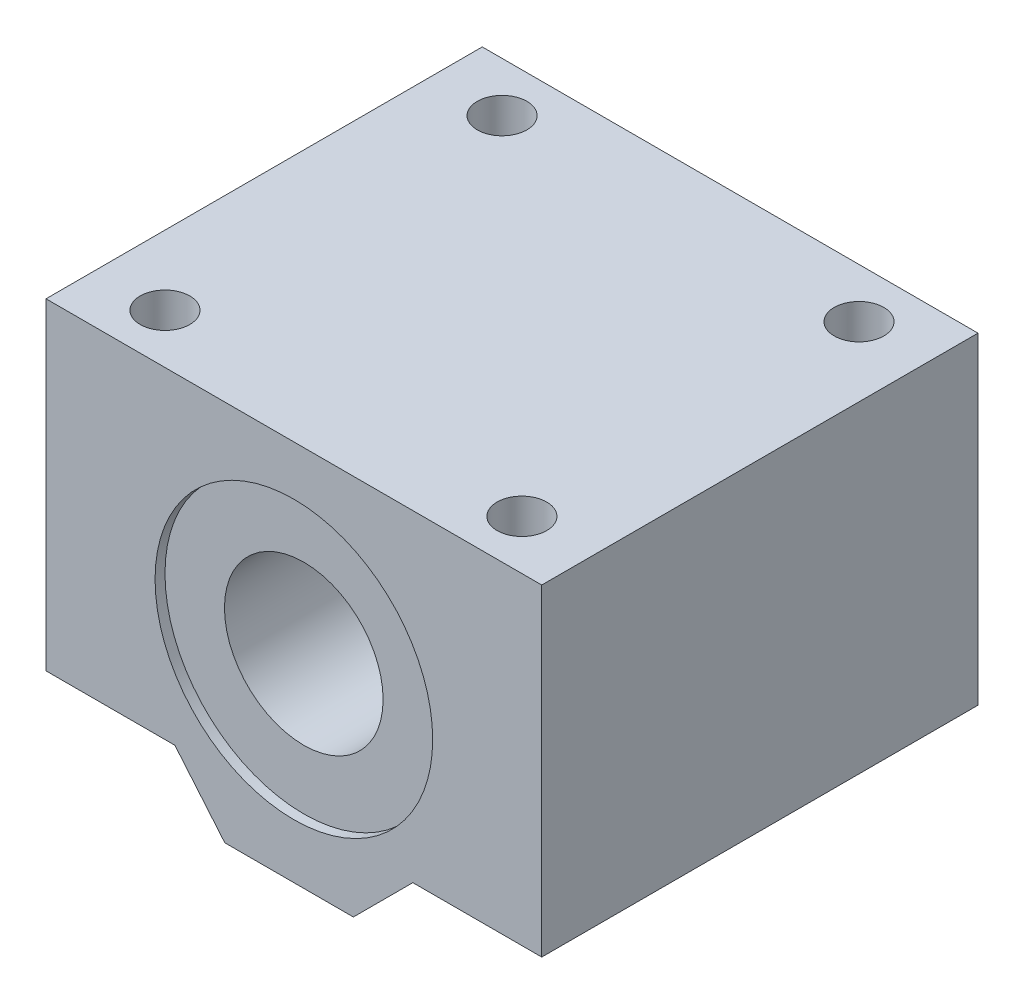
ISO-10303-21;
HEADER;
FILE_DESCRIPTION(('STEP AP214'),'2;1');
FILE_NAME('part.step','',(''),(''),'','','');
FILE_SCHEMA(('AUTOMOTIVE_DESIGN { 1 0 10303 214 1 1 1 1 }'));
ENDSEC;
DATA;
#1=APPLICATION_CONTEXT('core data for automotive mechanical design processes');
#2=APPLICATION_PROTOCOL_DEFINITION('international standard','automotive_design',2000,#1);
#3=PRODUCT_CONTEXT('',#1,'mechanical');
#4=PRODUCT('Part','Part','',(#3));
#5=PRODUCT_RELATED_PRODUCT_CATEGORY('part','',(#4));
#6=PRODUCT_DEFINITION_FORMATION('','',#4);
#7=PRODUCT_DEFINITION_CONTEXT('part definition',#1,'design');
#8=PRODUCT_DEFINITION('design','',#6,#7);
#9=PRODUCT_DEFINITION_SHAPE('','',#8);
#10=(LENGTH_UNIT() NAMED_UNIT(*) SI_UNIT(.MILLI.,.METRE.));
#11=(NAMED_UNIT(*) PLANE_ANGLE_UNIT() SI_UNIT($,.RADIAN.));
#12=(NAMED_UNIT(*) SI_UNIT($,.STERADIAN.) SOLID_ANGLE_UNIT());
#13=UNCERTAINTY_MEASURE_WITH_UNIT(LENGTH_MEASURE(1.E-05),#10,'distance_accuracy_value','');
#14=(GEOMETRIC_REPRESENTATION_CONTEXT(3) GLOBAL_UNCERTAINTY_ASSIGNED_CONTEXT((#13)) GLOBAL_UNIT_ASSIGNED_CONTEXT((#10,
#11,#12)) REPRESENTATION_CONTEXT('',''));
#15=CARTESIAN_POINT('',(0.,0.,0.));
#16=DIRECTION('',(0.,0.,1.));
#17=DIRECTION('',(1.,0.,0.));
#18=AXIS2_PLACEMENT_3D('',#15,#16,#17);
#19=CARTESIAN_POINT('',(0.,0.25,22.));
#20=DIRECTION('',(0.,0.,-1.));
#21=DIRECTION('',(-1.,0.,0.));
#22=AXIS2_PLACEMENT_3D('',#19,#20,#21);
#23=CYLINDRICAL_SURFACE('',#22,8.);
#24=CARTESIAN_POINT('',(0.,0.25,21.));
#25=DIRECTION('',(0.,0.,1.));
#26=DIRECTION('',(1.,0.,0.));
#27=AXIS2_PLACEMENT_3D('',#24,#25,#26);
#28=CIRCLE('',#27,8.);
#29=CARTESIAN_POINT('',(8.,0.25,21.));
#30=VERTEX_POINT('',#29);
#31=EDGE_CURVE('E173',#30,#30,#28,.T.);
#32=ORIENTED_EDGE('',*,*,#31,.T.);
#33=EDGE_LOOP('',(#32));
#34=FACE_BOUND('',#33,.T.);
#35=CARTESIAN_POINT('',(0.,0.25,-21.));
#36=DIRECTION('',(0.,0.,-1.));
#37=DIRECTION('',(-1.,0.,0.));
#38=AXIS2_PLACEMENT_3D('',#35,#36,#37);
#39=CIRCLE('',#38,8.);
#40=CARTESIAN_POINT('',(-8.,0.25,-21.));
#41=VERTEX_POINT('',#40);
#42=EDGE_CURVE('E38',#41,#41,#39,.T.);
#43=ORIENTED_EDGE('',*,*,#42,.T.);
#44=EDGE_LOOP('',(#43));
#45=FACE_BOUND('',#44,.T.);
#46=ADVANCED_FACE('F34',(#34,#45),#23,.F.);
#47=CARTESIAN_POINT('',(-25.,19.25,22.));
#48=DIRECTION('',(0.,-1.,0.));
#49=DIRECTION('',(0.,0.,-1.));
#50=AXIS2_PLACEMENT_3D('',#47,#48,#49);
#51=PLANE('',#50);
#52=CARTESIAN_POINT('',(18.,19.25,-17.));
#53=DIRECTION('',(0.,-1.,0.));
#54=DIRECTION('',(0.,0.,-1.));
#55=AXIS2_PLACEMENT_3D('',#52,#53,#54);
#56=CIRCLE('',#55,2.5);
#57=CARTESIAN_POINT('',(18.,19.25,-19.5));
#58=VERTEX_POINT('',#57);
#59=EDGE_CURVE('E171',#58,#58,#56,.T.);
#60=ORIENTED_EDGE('',*,*,#59,.T.);
#61=EDGE_LOOP('',(#60));
#62=FACE_BOUND('',#61,.T.);
#63=CARTESIAN_POINT('',(-18.,19.25,17.));
#64=DIRECTION('',(0.,-1.,0.));
#65=DIRECTION('',(0.,0.,-1.));
#66=AXIS2_PLACEMENT_3D('',#63,#64,#65);
#67=CIRCLE('',#66,2.5);
#68=CARTESIAN_POINT('',(-18.,19.25,14.5));
#69=VERTEX_POINT('',#68);
#70=EDGE_CURVE('E162',#69,#69,#67,.T.);
#71=ORIENTED_EDGE('',*,*,#70,.T.);
#72=EDGE_LOOP('',(#71));
#73=FACE_BOUND('',#72,.T.);
#74=DIRECTION('',(-1.,0.,0.));
#75=VECTOR('',#74,1.);
#76=CARTESIAN_POINT('',(-25.,19.25,-22.));
#77=LINE('',#76,#75);
#78=CARTESIAN_POINT('',(25.,19.25,-22.));
#79=VERTEX_POINT('',#78);
#80=CARTESIAN_POINT('',(-25.,19.25,-22.));
#81=VERTEX_POINT('',#80);
#82=EDGE_CURVE('E123',#79,#81,#77,.T.);
#83=ORIENTED_EDGE('',*,*,#82,.T.);
#84=DIRECTION('',(0.,0.,-1.));
#85=VECTOR('',#84,1.);
#86=CARTESIAN_POINT('',(-25.,19.25,22.));
#87=LINE('',#86,#85);
#88=CARTESIAN_POINT('',(-25.,19.25,22.));
#89=VERTEX_POINT('',#88);
#90=EDGE_CURVE('E43',#89,#81,#87,.T.);
#91=ORIENTED_EDGE('',*,*,#90,.F.);
#92=DIRECTION('',(-1.,0.,0.));
#93=VECTOR('',#92,1.);
#94=CARTESIAN_POINT('',(-25.,19.25,22.));
#95=LINE('',#94,#93);
#96=CARTESIAN_POINT('',(25.,19.25,22.));
#97=VERTEX_POINT('',#96);
#98=EDGE_CURVE('E225',#97,#89,#95,.T.);
#99=ORIENTED_EDGE('',*,*,#98,.F.);
#100=DIRECTION('',(0.,0.,-1.));
#101=VECTOR('',#100,1.);
#102=CARTESIAN_POINT('',(25.,19.25,22.));
#103=LINE('',#102,#101);
#104=EDGE_CURVE('E11',#97,#79,#103,.T.);
#105=ORIENTED_EDGE('',*,*,#104,.T.);
#106=EDGE_LOOP('',(#83,#91,#99,#105));
#107=FACE_BOUND('',#106,.T.);
#108=CARTESIAN_POINT('',(18.,19.25,17.));
#109=DIRECTION('',(0.,-1.,0.));
#110=DIRECTION('',(0.,0.,-1.));
#111=AXIS2_PLACEMENT_3D('',#108,#109,#110);
#112=CIRCLE('',#111,2.5);
#113=CARTESIAN_POINT('',(18.,19.25,14.5));
#114=VERTEX_POINT('',#113);
#115=EDGE_CURVE('E167',#114,#114,#112,.T.);
#116=ORIENTED_EDGE('',*,*,#115,.T.);
#117=EDGE_LOOP('',(#116));
#118=FACE_BOUND('',#117,.T.);
#119=CARTESIAN_POINT('',(-18.,19.25,-17.));
#120=DIRECTION('',(0.,-1.,0.));
#121=DIRECTION('',(0.,0.,-1.));
#122=AXIS2_PLACEMENT_3D('',#119,#120,#121);
#123=CIRCLE('',#122,2.5);
#124=CARTESIAN_POINT('',(-18.,19.25,-19.5));
#125=VERTEX_POINT('',#124);
#126=EDGE_CURVE('E175',#125,#125,#123,.T.);
#127=ORIENTED_EDGE('',*,*,#126,.T.);
#128=EDGE_LOOP('',(#127));
#129=FACE_BOUND('',#128,.T.);
#130=ADVANCED_FACE('F246',(#62,#73,#107,#118,#129),#51,.F.);
#131=CARTESIAN_POINT('',(-25.,-13.25,-22.));
#132=DIRECTION('',(0.,1.,0.));
#133=DIRECTION('',(-1.,0.,0.));
#134=AXIS2_PLACEMENT_3D('',#131,#132,#133);
#135=PLANE('',#134);
#136=CARTESIAN_POINT('',(-18.,-13.25,17.));
#137=DIRECTION('',(0.,1.,0.));
#138=DIRECTION('',(-1.,0.,0.));
#139=AXIS2_PLACEMENT_3D('',#136,#137,#138);
#140=CIRCLE('',#139,2.15);
#141=CARTESIAN_POINT('',(-20.15,-13.25,17.));
#142=VERTEX_POINT('',#141);
#143=EDGE_CURVE('E142',#142,#142,#140,.F.);
#144=ORIENTED_EDGE('',*,*,#143,.F.);
#145=EDGE_LOOP('',(#144));
#146=FACE_BOUND('',#145,.T.);
#147=DIRECTION('',(-1.,0.,0.));
#148=VECTOR('',#147,1.);
#149=CARTESIAN_POINT('',(-25.,-13.25,22.));
#150=LINE('',#149,#148);
#151=CARTESIAN_POINT('',(-12.,-13.25,22.));
#152=VERTEX_POINT('',#151);
#153=CARTESIAN_POINT('',(-25.,-13.25,22.));
#154=VERTEX_POINT('',#153);
#155=EDGE_CURVE('E215',#152,#154,#150,.T.);
#156=ORIENTED_EDGE('',*,*,#155,.T.);
#157=DIRECTION('',(0.,0.,1.));
#158=VECTOR('',#157,1.);
#159=CARTESIAN_POINT('',(-25.,-13.25,-22.));
#160=LINE('',#159,#158);
#161=CARTESIAN_POINT('',(-25.,-13.25,-22.));
#162=VERTEX_POINT('',#161);
#163=EDGE_CURVE('E124',#162,#154,#160,.T.);
#164=ORIENTED_EDGE('',*,*,#163,.F.);
#165=DIRECTION('',(-1.,0.,0.));
#166=VECTOR('',#165,1.);
#167=CARTESIAN_POINT('',(-25.,-13.25,-22.));
#168=LINE('',#167,#166);
#169=CARTESIAN_POINT('',(-12.,-13.25,-22.));
#170=VERTEX_POINT('',#169);
#171=EDGE_CURVE('E214',#170,#162,#168,.T.);
#172=ORIENTED_EDGE('',*,*,#171,.F.);
#173=DIRECTION('',(0.,0.,1.));
#174=VECTOR('',#173,1.);
#175=CARTESIAN_POINT('',(-12.,-13.25,-22.));
#176=LINE('',#175,#174);
#177=EDGE_CURVE('E129',#170,#152,#176,.T.);
#178=ORIENTED_EDGE('',*,*,#177,.T.);
#179=EDGE_LOOP('',(#156,#164,#172,#178));
#180=FACE_BOUND('',#179,.T.);
#181=CARTESIAN_POINT('',(-18.,-13.25,-17.));
#182=DIRECTION('',(0.,1.,0.));
#183=DIRECTION('',(-1.,0.,0.));
#184=AXIS2_PLACEMENT_3D('',#181,#182,#183);
#185=CIRCLE('',#184,2.15);
#186=CARTESIAN_POINT('',(-20.15,-13.25,-17.));
#187=VERTEX_POINT('',#186);
#188=EDGE_CURVE('E152',#187,#187,#185,.F.);
#189=ORIENTED_EDGE('',*,*,#188,.F.);
#190=EDGE_LOOP('',(#189));
#191=FACE_BOUND('',#190,.T.);
#192=ADVANCED_FACE('F249',(#146,#180,#191),#135,.F.);
#193=CARTESIAN_POINT('',(25.,-13.25,-22.));
#194=DIRECTION('',(0.,1.,0.));
#195=DIRECTION('',(-1.,0.,0.));
#196=AXIS2_PLACEMENT_3D('',#193,#194,#195);
#197=PLANE('',#196);
#198=CARTESIAN_POINT('',(18.,-13.25,17.));
#199=DIRECTION('',(0.,1.,0.));
#200=DIRECTION('',(-1.,0.,0.));
#201=AXIS2_PLACEMENT_3D('',#198,#199,#200);
#202=CIRCLE('',#201,2.15);
#203=CARTESIAN_POINT('',(15.85,-13.25,17.));
#204=VERTEX_POINT('',#203);
#205=EDGE_CURVE('E146',#204,#204,#202,.F.);
#206=ORIENTED_EDGE('',*,*,#205,.F.);
#207=EDGE_LOOP('',(#206));
#208=FACE_BOUND('',#207,.T.);
#209=DIRECTION('',(-1.,0.,0.));
#210=VECTOR('',#209,1.);
#211=CARTESIAN_POINT('',(25.,-13.25,22.));
#212=LINE('',#211,#210);
#213=CARTESIAN_POINT('',(25.,-13.25,22.));
#214=VERTEX_POINT('',#213);
#215=CARTESIAN_POINT('',(12.,-13.25,22.));
#216=VERTEX_POINT('',#215);
#217=EDGE_CURVE('E145',#214,#216,#212,.T.);
#218=ORIENTED_EDGE('',*,*,#217,.T.);
#219=DIRECTION('',(0.,0.,1.));
#220=VECTOR('',#219,1.);
#221=CARTESIAN_POINT('',(12.,-13.25,-22.));
#222=LINE('',#221,#220);
#223=CARTESIAN_POINT('',(12.,-13.25,-22.));
#224=VERTEX_POINT('',#223);
#225=EDGE_CURVE('E107',#224,#216,#222,.T.);
#226=ORIENTED_EDGE('',*,*,#225,.F.);
#227=DIRECTION('',(-1.,0.,0.));
#228=VECTOR('',#227,1.);
#229=CARTESIAN_POINT('',(25.,-13.25,-22.));
#230=LINE('',#229,#228);
#231=CARTESIAN_POINT('',(25.,-13.25,-22.));
#232=VERTEX_POINT('',#231);
#233=EDGE_CURVE('E100',#232,#224,#230,.T.);
#234=ORIENTED_EDGE('',*,*,#233,.F.);
#235=DIRECTION('',(0.,0.,1.));
#236=VECTOR('',#235,1.);
#237=CARTESIAN_POINT('',(25.,-13.25,-22.));
#238=LINE('',#237,#236);
#239=EDGE_CURVE('E105',#232,#214,#238,.T.);
#240=ORIENTED_EDGE('',*,*,#239,.T.);
#241=EDGE_LOOP('',(#218,#226,#234,#240));
#242=FACE_BOUND('',#241,.T.);
#243=CARTESIAN_POINT('',(18.,-13.25,-17.));
#244=DIRECTION('',(0.,1.,0.));
#245=DIRECTION('',(-1.,0.,0.));
#246=AXIS2_PLACEMENT_3D('',#243,#244,#245);
#247=CIRCLE('',#246,2.15);
#248=CARTESIAN_POINT('',(15.85,-13.25,-17.));
#249=VERTEX_POINT('',#248);
#250=EDGE_CURVE('E149',#249,#249,#247,.F.);
#251=ORIENTED_EDGE('',*,*,#250,.F.);
#252=EDGE_LOOP('',(#251));
#253=FACE_BOUND('',#252,.T.);
#254=ADVANCED_FACE('F103',(#208,#242,#253),#197,.F.);
#255=CARTESIAN_POINT('',(0.,0.,22.));
#256=DIRECTION('',(0.,0.,-1.));
#257=DIRECTION('',(-1.,0.,0.));
#258=AXIS2_PLACEMENT_3D('',#255,#256,#257);
#259=PLANE('',#258);
#260=CARTESIAN_POINT('',(0.,0.25,22.));
#261=DIRECTION('',(0.,0.,1.));
#262=DIRECTION('',(1.,0.,0.));
#263=AXIS2_PLACEMENT_3D('',#260,#261,#262);
#264=CIRCLE('',#263,14.);
#265=CARTESIAN_POINT('',(14.,0.25,22.));
#266=VERTEX_POINT('',#265);
#267=EDGE_CURVE('E182',#266,#266,#264,.T.);
#268=ORIENTED_EDGE('',*,*,#267,.F.);
#269=EDGE_LOOP('',(#268));
#270=FACE_BOUND('',#269,.T.);
#271=DIRECTION('',(1.,0.,0.));
#272=VECTOR('',#271,1.);
#273=CARTESIAN_POINT('',(-25.,-19.25,22.));
#274=LINE('',#273,#272);
#275=CARTESIAN_POINT('',(-6.96540221293635,-19.25,22.));
#276=VERTEX_POINT('',#275);
#277=CARTESIAN_POINT('',(6.00000000000003,-19.25,22.));
#278=VERTEX_POINT('',#277);
#279=EDGE_CURVE('E132',#276,#278,#274,.T.);
#280=ORIENTED_EDGE('',*,*,#279,.T.);
#281=DIRECTION('',(-0.707106781186546,-0.707106781186549,0.));
#282=VECTOR('',#281,1.);
#283=CARTESIAN_POINT('',(12.,-13.25,22.));
#284=LINE('',#283,#282);
#285=EDGE_CURVE('E51',#216,#278,#284,.T.);
#286=ORIENTED_EDGE('',*,*,#285,.F.);
#287=ORIENTED_EDGE('',*,*,#217,.F.);
#288=DIRECTION('',(0.,1.,0.));
#289=VECTOR('',#288,1.);
#290=CARTESIAN_POINT('',(25.,-19.25,22.));
#291=LINE('',#290,#289);
#292=EDGE_CURVE('E119',#214,#97,#291,.T.);
#293=ORIENTED_EDGE('',*,*,#292,.T.);
#294=ORIENTED_EDGE('',*,*,#98,.T.);
#295=DIRECTION('',(0.,-1.,0.));
#296=VECTOR('',#295,1.);
#297=CARTESIAN_POINT('',(-25.,-19.25,22.));
#298=LINE('',#297,#296);
#299=EDGE_CURVE('E226',#89,#154,#298,.T.);
#300=ORIENTED_EDGE('',*,*,#299,.T.);
#301=ORIENTED_EDGE('',*,*,#155,.F.);
#302=DIRECTION('',(-0.642787609686538,0.766044443118979,0.));
#303=VECTOR('',#302,1.);
#304=CARTESIAN_POINT('',(-12.,-13.25,22.));
#305=LINE('',#304,#303);
#306=EDGE_CURVE('E211',#276,#152,#305,.T.);
#307=ORIENTED_EDGE('',*,*,#306,.F.);
#308=EDGE_LOOP('',(#280,#286,#287,#293,#294,#300,#301,#307));
#309=FACE_BOUND('',#308,.T.);
#310=ADVANCED_FACE('F234',(#270,#309),#259,.F.);
#311=CARTESIAN_POINT('',(0.,0.,-22.));
#312=DIRECTION('',(0.,0.,-1.));
#313=DIRECTION('',(-1.,0.,0.));
#314=AXIS2_PLACEMENT_3D('',#311,#312,#313);
#315=PLANE('',#314);
#316=CARTESIAN_POINT('',(0.,0.25,-22.));
#317=DIRECTION('',(0.,0.,-1.));
#318=DIRECTION('',(-1.,0.,0.));
#319=AXIS2_PLACEMENT_3D('',#316,#317,#318);
#320=CIRCLE('',#319,14.);
#321=CARTESIAN_POINT('',(-14.,0.25,-22.));
#322=VERTEX_POINT('',#321);
#323=EDGE_CURVE('E189',#322,#322,#320,.T.);
#324=ORIENTED_EDGE('',*,*,#323,.F.);
#325=EDGE_LOOP('',(#324));
#326=FACE_BOUND('',#325,.T.);
#327=DIRECTION('',(-0.707106781186546,-0.707106781186549,0.));
#328=VECTOR('',#327,1.);
#329=CARTESIAN_POINT('',(12.,-13.25,-22.));
#330=LINE('',#329,#328);
#331=CARTESIAN_POINT('',(6.00000000000003,-19.25,-22.));
#332=VERTEX_POINT('',#331);
#333=EDGE_CURVE('E112',#224,#332,#330,.T.);
#334=ORIENTED_EDGE('',*,*,#333,.T.);
#335=DIRECTION('',(1.,0.,0.));
#336=VECTOR('',#335,1.);
#337=CARTESIAN_POINT('',(-25.,-19.25,-22.));
#338=LINE('',#337,#336);
#339=CARTESIAN_POINT('',(-6.96540221293635,-19.25,-22.));
#340=VERTEX_POINT('',#339);
#341=EDGE_CURVE('E137',#340,#332,#338,.T.);
#342=ORIENTED_EDGE('',*,*,#341,.F.);
#343=DIRECTION('',(-0.642787609686538,0.766044443118979,0.));
#344=VECTOR('',#343,1.);
#345=CARTESIAN_POINT('',(-12.,-13.25,-22.));
#346=LINE('',#345,#344);
#347=EDGE_CURVE('E59',#340,#170,#346,.T.);
#348=ORIENTED_EDGE('',*,*,#347,.T.);
#349=ORIENTED_EDGE('',*,*,#171,.T.);
#350=DIRECTION('',(0.,-1.,0.));
#351=VECTOR('',#350,1.);
#352=CARTESIAN_POINT('',(-25.,-19.25,-22.));
#353=LINE('',#352,#351);
#354=EDGE_CURVE('E126',#81,#162,#353,.T.);
#355=ORIENTED_EDGE('',*,*,#354,.F.);
#356=ORIENTED_EDGE('',*,*,#82,.F.);
#357=DIRECTION('',(0.,1.,0.));
#358=VECTOR('',#357,1.);
#359=CARTESIAN_POINT('',(25.,-19.25,-22.));
#360=LINE('',#359,#358);
#361=EDGE_CURVE('E117',#232,#79,#360,.T.);
#362=ORIENTED_EDGE('',*,*,#361,.F.);
#363=ORIENTED_EDGE('',*,*,#233,.T.);
#364=EDGE_LOOP('',(#334,#342,#348,#349,#355,#356,#362,#363));
#365=FACE_BOUND('',#364,.T.);
#366=ADVANCED_FACE('F121',(#326,#365),#315,.T.);
#367=CARTESIAN_POINT('',(25.,-19.25,22.));
#368=DIRECTION('',(-1.,0.,0.));
#369=DIRECTION('',(0.,0.,1.));
#370=AXIS2_PLACEMENT_3D('',#367,#368,#369);
#371=PLANE('',#370);
#372=ORIENTED_EDGE('',*,*,#292,.F.);
#373=ORIENTED_EDGE('',*,*,#239,.F.);
#374=ORIENTED_EDGE('',*,*,#361,.T.);
#375=ORIENTED_EDGE('',*,*,#104,.F.);
#376=EDGE_LOOP('',(#372,#373,#374,#375));
#377=FACE_BOUND('',#376,.T.);
#378=ADVANCED_FACE('F36',(#377),#371,.F.);
#379=CARTESIAN_POINT('',(-25.,-19.25,22.));
#380=DIRECTION('',(1.,0.,0.));
#381=DIRECTION('',(0.,0.,-1.));
#382=AXIS2_PLACEMENT_3D('',#379,#380,#381);
#383=PLANE('',#382);
#384=ORIENTED_EDGE('',*,*,#354,.T.);
#385=ORIENTED_EDGE('',*,*,#163,.T.);
#386=ORIENTED_EDGE('',*,*,#299,.F.);
#387=ORIENTED_EDGE('',*,*,#90,.T.);
#388=EDGE_LOOP('',(#384,#385,#386,#387));
#389=FACE_BOUND('',#388,.T.);
#390=ADVANCED_FACE('F242',(#389),#383,.F.);
#391=CARTESIAN_POINT('',(-25.,-19.25,22.));
#392=DIRECTION('',(0.,1.,0.));
#393=DIRECTION('',(0.,0.,1.));
#394=AXIS2_PLACEMENT_3D('',#391,#392,#393);
#395=PLANE('',#394);
#396=ORIENTED_EDGE('',*,*,#341,.T.);
#397=DIRECTION('',(0.,0.,1.));
#398=VECTOR('',#397,1.);
#399=CARTESIAN_POINT('',(6.00000000000003,-19.25,-22.));
#400=LINE('',#399,#398);
#401=EDGE_CURVE('E209',#332,#278,#400,.T.);
#402=ORIENTED_EDGE('',*,*,#401,.T.);
#403=ORIENTED_EDGE('',*,*,#279,.F.);
#404=DIRECTION('',(0.,0.,1.));
#405=VECTOR('',#404,1.);
#406=CARTESIAN_POINT('',(-6.96540221293635,-19.25,-22.));
#407=LINE('',#406,#405);
#408=EDGE_CURVE('E218',#340,#276,#407,.T.);
#409=ORIENTED_EDGE('',*,*,#408,.F.);
#410=EDGE_LOOP('',(#396,#402,#403,#409));
#411=FACE_BOUND('',#410,.T.);
#412=ADVANCED_FACE('F236',(#411),#395,.F.);
#413=CARTESIAN_POINT('',(-12.,-13.25,-22.));
#414=DIRECTION('',(0.766044443118979,0.642787609686538,0.));
#415=DIRECTION('',(-0.642787609686538,0.766044443118979,0.));
#416=AXIS2_PLACEMENT_3D('',#413,#414,#415);
#417=PLANE('',#416);
#418=ORIENTED_EDGE('',*,*,#306,.T.);
#419=ORIENTED_EDGE('',*,*,#177,.F.);
#420=ORIENTED_EDGE('',*,*,#347,.F.);
#421=ORIENTED_EDGE('',*,*,#408,.T.);
#422=EDGE_LOOP('',(#418,#419,#420,#421));
#423=FACE_BOUND('',#422,.T.);
#424=ADVANCED_FACE('F278',(#423),#417,.F.);
#425=CARTESIAN_POINT('',(12.,-13.25,-22.));
#426=DIRECTION('',(-0.707106781186549,0.707106781186546,0.));
#427=DIRECTION('',(-0.707106781186546,-0.707106781186549,0.));
#428=AXIS2_PLACEMENT_3D('',#425,#426,#427);
#429=PLANE('',#428);
#430=ORIENTED_EDGE('',*,*,#285,.T.);
#431=ORIENTED_EDGE('',*,*,#401,.F.);
#432=ORIENTED_EDGE('',*,*,#333,.F.);
#433=ORIENTED_EDGE('',*,*,#225,.T.);
#434=EDGE_LOOP('',(#430,#431,#432,#433));
#435=FACE_BOUND('',#434,.T.);
#436=ADVANCED_FACE('F238',(#435),#429,.F.);
#437=CARTESIAN_POINT('',(-18.,-19.25,17.));
#438=DIRECTION('',(0.,1.,0.));
#439=DIRECTION('',(0.,0.,1.));
#440=AXIS2_PLACEMENT_3D('',#437,#438,#439);
#441=CYLINDRICAL_SURFACE('',#440,2.15);
#442=CARTESIAN_POINT('',(-18.,7.25,17.));
#443=DIRECTION('',(0.,-1.,0.));
#444=DIRECTION('',(0.,0.,-1.));
#445=AXIS2_PLACEMENT_3D('',#442,#443,#444);
#446=CIRCLE('',#445,2.15);
#447=CARTESIAN_POINT('',(-18.,7.25,14.85));
#448=VERTEX_POINT('',#447);
#449=EDGE_CURVE('E155',#448,#448,#446,.T.);
#450=ORIENTED_EDGE('',*,*,#449,.F.);
#451=EDGE_LOOP('',(#450));
#452=FACE_BOUND('',#451,.T.);
#453=ORIENTED_EDGE('',*,*,#143,.T.);
#454=EDGE_LOOP('',(#453));
#455=FACE_BOUND('',#454,.T.);
#456=ADVANCED_FACE('F330',(#452,#455),#441,.F.);
#457=CARTESIAN_POINT('',(18.,-19.25,17.));
#458=DIRECTION('',(0.,1.,0.));
#459=DIRECTION('',(0.,0.,1.));
#460=AXIS2_PLACEMENT_3D('',#457,#458,#459);
#461=CYLINDRICAL_SURFACE('',#460,2.15);
#462=CARTESIAN_POINT('',(18.,7.25,17.));
#463=DIRECTION('',(0.,-1.,0.));
#464=DIRECTION('',(0.,0.,-1.));
#465=AXIS2_PLACEMENT_3D('',#462,#463,#464);
#466=CIRCLE('',#465,2.15);
#467=CARTESIAN_POINT('',(18.,7.25,14.85));
#468=VERTEX_POINT('',#467);
#469=EDGE_CURVE('E159',#468,#468,#466,.T.);
#470=ORIENTED_EDGE('',*,*,#469,.F.);
#471=EDGE_LOOP('',(#470));
#472=FACE_BOUND('',#471,.T.);
#473=ORIENTED_EDGE('',*,*,#205,.T.);
#474=EDGE_LOOP('',(#473));
#475=FACE_BOUND('',#474,.T.);
#476=ADVANCED_FACE('F335',(#472,#475),#461,.F.);
#477=CARTESIAN_POINT('',(18.,-19.25,-17.));
#478=DIRECTION('',(0.,1.,0.));
#479=DIRECTION('',(0.,0.,1.));
#480=AXIS2_PLACEMENT_3D('',#477,#478,#479);
#481=CYLINDRICAL_SURFACE('',#480,2.15);
#482=CARTESIAN_POINT('',(18.,7.25,-17.));
#483=DIRECTION('',(0.,-1.,0.));
#484=DIRECTION('',(0.,0.,-1.));
#485=AXIS2_PLACEMENT_3D('',#482,#483,#484);
#486=CIRCLE('',#485,2.15);
#487=CARTESIAN_POINT('',(18.,7.25,-19.15));
#488=VERTEX_POINT('',#487);
#489=EDGE_CURVE('E164',#488,#488,#486,.T.);
#490=ORIENTED_EDGE('',*,*,#489,.F.);
#491=EDGE_LOOP('',(#490));
#492=FACE_BOUND('',#491,.T.);
#493=ORIENTED_EDGE('',*,*,#250,.T.);
#494=EDGE_LOOP('',(#493));
#495=FACE_BOUND('',#494,.T.);
#496=ADVANCED_FACE('F346',(#492,#495),#481,.F.);
#497=CARTESIAN_POINT('',(-18.,-19.25,-17.));
#498=DIRECTION('',(0.,1.,0.));
#499=DIRECTION('',(0.,0.,1.));
#500=AXIS2_PLACEMENT_3D('',#497,#498,#499);
#501=CYLINDRICAL_SURFACE('',#500,2.15);
#502=CARTESIAN_POINT('',(-18.,7.25,-17.));
#503=DIRECTION('',(0.,-1.,0.));
#504=DIRECTION('',(0.,0.,-1.));
#505=AXIS2_PLACEMENT_3D('',#502,#503,#504);
#506=CIRCLE('',#505,2.15);
#507=CARTESIAN_POINT('',(-18.,7.25,-19.15));
#508=VERTEX_POINT('',#507);
#509=EDGE_CURVE('E169',#508,#508,#506,.T.);
#510=ORIENTED_EDGE('',*,*,#509,.F.);
#511=EDGE_LOOP('',(#510));
#512=FACE_BOUND('',#511,.T.);
#513=ORIENTED_EDGE('',*,*,#188,.T.);
#514=EDGE_LOOP('',(#513));
#515=FACE_BOUND('',#514,.T.);
#516=ADVANCED_FACE('F356',(#512,#515),#501,.F.);
#517=CARTESIAN_POINT('',(-18.,7.25,17.));
#518=DIRECTION('',(0.,1.,0.));
#519=DIRECTION('',(0.,0.,1.));
#520=AXIS2_PLACEMENT_3D('',#517,#518,#519);
#521=CYLINDRICAL_SURFACE('',#520,2.5);
#522=CARTESIAN_POINT('',(-18.,7.25,17.));
#523=DIRECTION('',(0.,-1.,0.));
#524=DIRECTION('',(0.,0.,-1.));
#525=AXIS2_PLACEMENT_3D('',#522,#523,#524);
#526=CIRCLE('',#525,2.5);
#527=CARTESIAN_POINT('',(-18.,7.25,14.5));
#528=VERTEX_POINT('',#527);
#529=EDGE_CURVE('E158',#528,#528,#526,.T.);
#530=ORIENTED_EDGE('',*,*,#529,.T.);
#531=EDGE_LOOP('',(#530));
#532=FACE_BOUND('',#531,.T.);
#533=ORIENTED_EDGE('',*,*,#70,.F.);
#534=EDGE_LOOP('',(#533));
#535=FACE_BOUND('',#534,.T.);
#536=ADVANCED_FACE('F365',(#532,#535),#521,.F.);
#537=CARTESIAN_POINT('',(-18.,7.25,17.));
#538=DIRECTION('',(0.,-1.,0.));
#539=DIRECTION('',(0.,0.,-1.));
#540=AXIS2_PLACEMENT_3D('',#537,#538,#539);
#541=PLANE('',#540);
#542=ORIENTED_EDGE('',*,*,#449,.T.);
#543=EDGE_LOOP('',(#542));
#544=FACE_BOUND('',#543,.T.);
#545=ORIENTED_EDGE('',*,*,#529,.F.);
#546=EDGE_LOOP('',(#545));
#547=FACE_BOUND('',#546,.T.);
#548=ADVANCED_FACE('F374',(#544,#547),#541,.F.);
#549=CARTESIAN_POINT('',(18.,7.25,17.));
#550=DIRECTION('',(0.,1.,0.));
#551=DIRECTION('',(0.,0.,1.));
#552=AXIS2_PLACEMENT_3D('',#549,#550,#551);
#553=CYLINDRICAL_SURFACE('',#552,2.5);
#554=CARTESIAN_POINT('',(18.,7.25,17.));
#555=DIRECTION('',(0.,-1.,0.));
#556=DIRECTION('',(0.,0.,-1.));
#557=AXIS2_PLACEMENT_3D('',#554,#555,#556);
#558=CIRCLE('',#557,2.5);
#559=CARTESIAN_POINT('',(18.,7.25,14.5));
#560=VERTEX_POINT('',#559);
#561=EDGE_CURVE('E163',#560,#560,#558,.T.);
#562=ORIENTED_EDGE('',*,*,#561,.T.);
#563=EDGE_LOOP('',(#562));
#564=FACE_BOUND('',#563,.T.);
#565=ORIENTED_EDGE('',*,*,#115,.F.);
#566=EDGE_LOOP('',(#565));
#567=FACE_BOUND('',#566,.T.);
#568=ADVANCED_FACE('F384',(#564,#567),#553,.F.);
#569=CARTESIAN_POINT('',(18.,7.25,17.));
#570=DIRECTION('',(0.,-1.,0.));
#571=DIRECTION('',(0.,0.,-1.));
#572=AXIS2_PLACEMENT_3D('',#569,#570,#571);
#573=PLANE('',#572);
#574=ORIENTED_EDGE('',*,*,#469,.T.);
#575=EDGE_LOOP('',(#574));
#576=FACE_BOUND('',#575,.T.);
#577=ORIENTED_EDGE('',*,*,#561,.F.);
#578=EDGE_LOOP('',(#577));
#579=FACE_BOUND('',#578,.T.);
#580=ADVANCED_FACE('F394',(#576,#579),#573,.F.);
#581=CARTESIAN_POINT('',(18.,7.25,-17.));
#582=DIRECTION('',(0.,1.,0.));
#583=DIRECTION('',(0.,0.,1.));
#584=AXIS2_PLACEMENT_3D('',#581,#582,#583);
#585=CYLINDRICAL_SURFACE('',#584,2.5);
#586=CARTESIAN_POINT('',(18.,7.25,-17.));
#587=DIRECTION('',(0.,-1.,0.));
#588=DIRECTION('',(0.,0.,-1.));
#589=AXIS2_PLACEMENT_3D('',#586,#587,#588);
#590=CIRCLE('',#589,2.5);
#591=CARTESIAN_POINT('',(18.,7.25,-19.5));
#592=VERTEX_POINT('',#591);
#593=EDGE_CURVE('E168',#592,#592,#590,.T.);
#594=ORIENTED_EDGE('',*,*,#593,.T.);
#595=EDGE_LOOP('',(#594));
#596=FACE_BOUND('',#595,.T.);
#597=ORIENTED_EDGE('',*,*,#59,.F.);
#598=EDGE_LOOP('',(#597));
#599=FACE_BOUND('',#598,.T.);
#600=ADVANCED_FACE('F268',(#596,#599),#585,.F.);
#601=CARTESIAN_POINT('',(18.,7.25,-17.));
#602=DIRECTION('',(0.,-1.,0.));
#603=DIRECTION('',(0.,0.,-1.));
#604=AXIS2_PLACEMENT_3D('',#601,#602,#603);
#605=PLANE('',#604);
#606=ORIENTED_EDGE('',*,*,#489,.T.);
#607=EDGE_LOOP('',(#606));
#608=FACE_BOUND('',#607,.T.);
#609=ORIENTED_EDGE('',*,*,#593,.F.);
#610=EDGE_LOOP('',(#609));
#611=FACE_BOUND('',#610,.T.);
#612=ADVANCED_FACE('F258',(#608,#611),#605,.F.);
#613=CARTESIAN_POINT('',(-18.,7.25,-17.));
#614=DIRECTION('',(0.,1.,0.));
#615=DIRECTION('',(0.,0.,1.));
#616=AXIS2_PLACEMENT_3D('',#613,#614,#615);
#617=CYLINDRICAL_SURFACE('',#616,2.5);
#618=CARTESIAN_POINT('',(-18.,7.25,-17.));
#619=DIRECTION('',(0.,-1.,0.));
#620=DIRECTION('',(0.,0.,-1.));
#621=AXIS2_PLACEMENT_3D('',#618,#619,#620);
#622=CIRCLE('',#621,2.5);
#623=CARTESIAN_POINT('',(-18.,7.25,-19.5));
#624=VERTEX_POINT('',#623);
#625=EDGE_CURVE('E172',#624,#624,#622,.T.);
#626=ORIENTED_EDGE('',*,*,#625,.T.);
#627=EDGE_LOOP('',(#626));
#628=FACE_BOUND('',#627,.T.);
#629=ORIENTED_EDGE('',*,*,#126,.F.);
#630=EDGE_LOOP('',(#629));
#631=FACE_BOUND('',#630,.T.);
#632=ADVANCED_FACE('F255',(#628,#631),#617,.F.);
#633=CARTESIAN_POINT('',(-18.,7.25,-17.));
#634=DIRECTION('',(0.,-1.,0.));
#635=DIRECTION('',(0.,0.,-1.));
#636=AXIS2_PLACEMENT_3D('',#633,#634,#635);
#637=PLANE('',#636);
#638=ORIENTED_EDGE('',*,*,#509,.T.);
#639=EDGE_LOOP('',(#638));
#640=FACE_BOUND('',#639,.T.);
#641=ORIENTED_EDGE('',*,*,#625,.F.);
#642=EDGE_LOOP('',(#641));
#643=FACE_BOUND('',#642,.T.);
#644=ADVANCED_FACE('F257',(#640,#643),#637,.F.);
#645=CARTESIAN_POINT('',(0.,0.25,21.));
#646=DIRECTION('',(0.,0.,1.));
#647=DIRECTION('',(1.,0.,0.));
#648=AXIS2_PLACEMENT_3D('',#645,#646,#647);
#649=CYLINDRICAL_SURFACE('',#648,14.);
#650=CARTESIAN_POINT('',(0.,0.25,21.));
#651=DIRECTION('',(0.,0.,1.));
#652=DIRECTION('',(1.,0.,0.));
#653=AXIS2_PLACEMENT_3D('',#650,#651,#652);
#654=CIRCLE('',#653,14.);
#655=CARTESIAN_POINT('',(14.,0.25,21.));
#656=VERTEX_POINT('',#655);
#657=EDGE_CURVE('E176',#656,#656,#654,.T.);
#658=ORIENTED_EDGE('',*,*,#657,.F.);
#659=EDGE_LOOP('',(#658));
#660=FACE_BOUND('',#659,.T.);
#661=ORIENTED_EDGE('',*,*,#267,.T.);
#662=EDGE_LOOP('',(#661));
#663=FACE_BOUND('',#662,.T.);
#664=ADVANCED_FACE('F265',(#660,#663),#649,.F.);
#665=CARTESIAN_POINT('',(0.,0.25,21.));
#666=DIRECTION('',(0.,0.,1.));
#667=DIRECTION('',(1.,0.,0.));
#668=AXIS2_PLACEMENT_3D('',#665,#666,#667);
#669=PLANE('',#668);
#670=ORIENTED_EDGE('',*,*,#31,.F.);
#671=EDGE_LOOP('',(#670));
#672=FACE_BOUND('',#671,.T.);
#673=ORIENTED_EDGE('',*,*,#657,.T.);
#674=EDGE_LOOP('',(#673));
#675=FACE_BOUND('',#674,.T.);
#676=ADVANCED_FACE('F436',(#672,#675),#669,.T.);
#677=CARTESIAN_POINT('',(0.,0.25,-21.));
#678=DIRECTION('',(0.,0.,-1.));
#679=DIRECTION('',(-1.,0.,0.));
#680=AXIS2_PLACEMENT_3D('',#677,#678,#679);
#681=CYLINDRICAL_SURFACE('',#680,14.);
#682=CARTESIAN_POINT('',(0.,0.25,-21.));
#683=DIRECTION('',(0.,0.,-1.));
#684=DIRECTION('',(-1.,0.,0.));
#685=AXIS2_PLACEMENT_3D('',#682,#683,#684);
#686=CIRCLE('',#685,14.);
#687=CARTESIAN_POINT('',(-14.,0.25,-21.));
#688=VERTEX_POINT('',#687);
#689=EDGE_CURVE('E482',#688,#688,#686,.T.);
#690=ORIENTED_EDGE('',*,*,#689,.F.);
#691=EDGE_LOOP('',(#690));
#692=FACE_BOUND('',#691,.T.);
#693=ORIENTED_EDGE('',*,*,#323,.T.);
#694=EDGE_LOOP('',(#693));
#695=FACE_BOUND('',#694,.T.);
#696=ADVANCED_FACE('F444',(#692,#695),#681,.F.);
#697=CARTESIAN_POINT('',(0.,0.25,-21.));
#698=DIRECTION('',(0.,0.,-1.));
#699=DIRECTION('',(-1.,0.,0.));
#700=AXIS2_PLACEMENT_3D('',#697,#698,#699);
#701=PLANE('',#700);
#702=ORIENTED_EDGE('',*,*,#42,.F.);
#703=EDGE_LOOP('',(#702));
#704=FACE_BOUND('',#703,.T.);
#705=ORIENTED_EDGE('',*,*,#689,.T.);
#706=EDGE_LOOP('',(#705));
#707=FACE_BOUND('',#706,.T.);
#708=ADVANCED_FACE('F451',(#704,#707),#701,.T.);
#709=CLOSED_SHELL('',(#46,#130,#192,#254,#310,#366,#378,#390,#412,#424,#436,#456,#476,#496,#516,
#536,#548,#568,#580,#600,#612,#632,#644,#664,#676,#696,#708));
#710=MANIFOLD_SOLID_BREP('B2',#709);
#711=ADVANCED_BREP_SHAPE_REPRESENTATION('',(#18,#710),#14);
#712=SHAPE_DEFINITION_REPRESENTATION(#9,#711);
ENDSEC;
END-ISO-10303-21;
